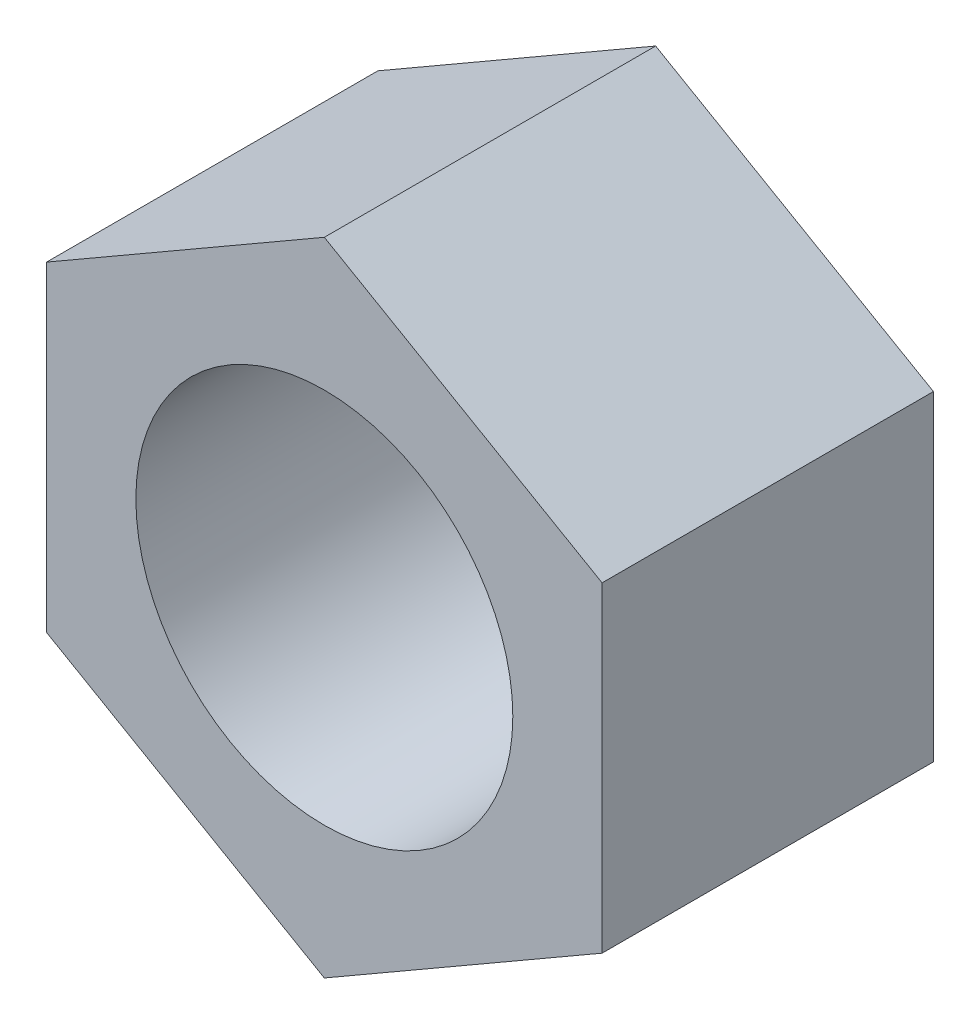
ISO-10303-21;
HEADER;
FILE_DESCRIPTION(('STEP AP214'),'2;1');
FILE_NAME('part.step','',(''),(''),'','','');
FILE_SCHEMA(('AUTOMOTIVE_DESIGN { 1 0 10303 214 1 1 1 1 }'));
ENDSEC;
DATA;
#1=APPLICATION_CONTEXT('core data for automotive mechanical design processes');
#2=APPLICATION_PROTOCOL_DEFINITION('international standard','automotive_design',2000,#1);
#3=PRODUCT_CONTEXT('',#1,'mechanical');
#4=PRODUCT('Part','Part','',(#3));
#5=PRODUCT_RELATED_PRODUCT_CATEGORY('part','',(#4));
#6=PRODUCT_DEFINITION_FORMATION('','',#4);
#7=PRODUCT_DEFINITION_CONTEXT('part definition',#1,'design');
#8=PRODUCT_DEFINITION('design','',#6,#7);
#9=PRODUCT_DEFINITION_SHAPE('','',#8);
#10=(LENGTH_UNIT() NAMED_UNIT(*) SI_UNIT(.MILLI.,.METRE.));
#11=(NAMED_UNIT(*) PLANE_ANGLE_UNIT() SI_UNIT($,.RADIAN.));
#12=(NAMED_UNIT(*) SI_UNIT($,.STERADIAN.) SOLID_ANGLE_UNIT());
#13=UNCERTAINTY_MEASURE_WITH_UNIT(LENGTH_MEASURE(1.E-05),#10,'distance_accuracy_value','');
#14=(GEOMETRIC_REPRESENTATION_CONTEXT(3) GLOBAL_UNCERTAINTY_ASSIGNED_CONTEXT((#13)) GLOBAL_UNIT_ASSIGNED_CONTEXT((#10,
#11,#12)) REPRESENTATION_CONTEXT('',''));
#15=CARTESIAN_POINT('',(0.,0.,0.));
#16=DIRECTION('',(0.,0.,1.));
#17=DIRECTION('',(1.,0.,0.));
#18=AXIS2_PLACEMENT_3D('',#15,#16,#17);
#19=CARTESIAN_POINT('',(0.,0.,8.35));
#20=DIRECTION('',(0.,0.,1.));
#21=DIRECTION('',(1.,0.,0.));
#22=AXIS2_PLACEMENT_3D('',#19,#20,#21);
#23=PLANE('',#22);
#24=DIRECTION('',(0.,1.,0.));
#25=VECTOR('',#24,1.);
#26=CARTESIAN_POINT('',(7.,-4.04145188432739,8.35));
#27=LINE('',#26,#25);
#28=CARTESIAN_POINT('',(7.,-4.04145188432739,8.35));
#29=VERTEX_POINT('',#28);
#30=CARTESIAN_POINT('',(7.,4.04145188432738,8.35));
#31=VERTEX_POINT('',#30);
#32=EDGE_CURVE('E129',#29,#31,#27,.T.);
#33=ORIENTED_EDGE('',*,*,#32,.T.);
#34=DIRECTION('',(-0.866025403784439,0.5,0.));
#35=VECTOR('',#34,1.);
#36=CARTESIAN_POINT('',(7.,4.04145188432738,8.35));
#37=LINE('',#36,#35);
#38=CARTESIAN_POINT('',(0.,8.08290376865476,8.35));
#39=VERTEX_POINT('',#38);
#40=EDGE_CURVE('E87',#31,#39,#37,.T.);
#41=ORIENTED_EDGE('',*,*,#40,.T.);
#42=DIRECTION('',(-0.866025403784439,-0.5,0.));
#43=VECTOR('',#42,1.);
#44=CARTESIAN_POINT('',(0.,8.08290376865476,8.35));
#45=LINE('',#44,#43);
#46=CARTESIAN_POINT('',(-7.,4.04145188432738,8.35));
#47=VERTEX_POINT('',#46);
#48=EDGE_CURVE('E100',#39,#47,#45,.T.);
#49=ORIENTED_EDGE('',*,*,#48,.T.);
#50=DIRECTION('',(0.,-1.,0.));
#51=VECTOR('',#50,1.);
#52=CARTESIAN_POINT('',(-7.,4.04145188432738,8.35));
#53=LINE('',#52,#51);
#54=CARTESIAN_POINT('',(-7.,-4.04145188432738,8.35));
#55=VERTEX_POINT('',#54);
#56=EDGE_CURVE('E94',#47,#55,#53,.T.);
#57=ORIENTED_EDGE('',*,*,#56,.T.);
#58=DIRECTION('',(0.866025403784439,-0.5,0.));
#59=VECTOR('',#58,1.);
#60=CARTESIAN_POINT('',(-7.,-4.04145188432738,8.35));
#61=LINE('',#60,#59);
#62=CARTESIAN_POINT('',(0.,-8.08290376865476,8.35));
#63=VERTEX_POINT('',#62);
#64=EDGE_CURVE('E98',#55,#63,#61,.T.);
#65=ORIENTED_EDGE('',*,*,#64,.T.);
#66=DIRECTION('',(0.866025403784438,0.5,0.));
#67=VECTOR('',#66,1.);
#68=CARTESIAN_POINT('',(0.,-8.08290376865476,8.35));
#69=LINE('',#68,#67);
#70=EDGE_CURVE('E50',#63,#29,#69,.T.);
#71=ORIENTED_EDGE('',*,*,#70,.T.);
#72=EDGE_LOOP('',(#33,#41,#49,#57,#65,#71));
#73=FACE_BOUND('',#72,.T.);
#74=CARTESIAN_POINT('',(0.,0.,8.35));
#75=DIRECTION('',(0.,0.,1.));
#76=DIRECTION('',(1.,0.,0.));
#77=AXIS2_PLACEMENT_3D('',#74,#75,#76);
#78=CIRCLE('',#77,4.75);
#79=CARTESIAN_POINT('',(4.75,0.,8.35));
#80=VERTEX_POINT('',#79);
#81=EDGE_CURVE('E122',#80,#80,#78,.T.);
#82=ORIENTED_EDGE('',*,*,#81,.F.);
#83=EDGE_LOOP('',(#82));
#84=FACE_BOUND('',#83,.T.);
#85=ADVANCED_FACE('F33',(#73,#84),#23,.T.);
#86=CARTESIAN_POINT('',(0.,0.,0.));
#87=DIRECTION('',(0.,0.,1.));
#88=DIRECTION('',(1.,0.,0.));
#89=AXIS2_PLACEMENT_3D('',#86,#87,#88);
#90=PLANE('',#89);
#91=DIRECTION('',(0.,1.,0.));
#92=VECTOR('',#91,1.);
#93=CARTESIAN_POINT('',(7.,-4.04145188432739,0.));
#94=LINE('',#93,#92);
#95=CARTESIAN_POINT('',(7.,-4.04145188432739,0.));
#96=VERTEX_POINT('',#95);
#97=CARTESIAN_POINT('',(7.,4.04145188432738,0.));
#98=VERTEX_POINT('',#97);
#99=EDGE_CURVE('E118',#96,#98,#94,.T.);
#100=ORIENTED_EDGE('',*,*,#99,.F.);
#101=DIRECTION('',(0.866025403784438,0.5,0.));
#102=VECTOR('',#101,1.);
#103=CARTESIAN_POINT('',(0.,-8.08290376865476,0.));
#104=LINE('',#103,#102);
#105=CARTESIAN_POINT('',(0.,-8.08290376865476,0.));
#106=VERTEX_POINT('',#105);
#107=EDGE_CURVE('E79',#106,#96,#104,.T.);
#108=ORIENTED_EDGE('',*,*,#107,.F.);
#109=DIRECTION('',(0.866025403784439,-0.5,0.));
#110=VECTOR('',#109,1.);
#111=CARTESIAN_POINT('',(-7.,-4.04145188432738,0.));
#112=LINE('',#111,#110);
#113=CARTESIAN_POINT('',(-7.,-4.04145188432738,0.));
#114=VERTEX_POINT('',#113);
#115=EDGE_CURVE('E73',#114,#106,#112,.T.);
#116=ORIENTED_EDGE('',*,*,#115,.F.);
#117=DIRECTION('',(0.,-1.,0.));
#118=VECTOR('',#117,1.);
#119=CARTESIAN_POINT('',(-7.,4.04145188432738,0.));
#120=LINE('',#119,#118);
#121=CARTESIAN_POINT('',(-7.,4.04145188432738,0.));
#122=VERTEX_POINT('',#121);
#123=EDGE_CURVE('E108',#122,#114,#120,.T.);
#124=ORIENTED_EDGE('',*,*,#123,.F.);
#125=DIRECTION('',(-0.866025403784439,-0.5,0.));
#126=VECTOR('',#125,1.);
#127=CARTESIAN_POINT('',(0.,8.08290376865476,0.));
#128=LINE('',#127,#126);
#129=CARTESIAN_POINT('',(0.,8.08290376865476,0.));
#130=VERTEX_POINT('',#129);
#131=EDGE_CURVE('E124',#130,#122,#128,.T.);
#132=ORIENTED_EDGE('',*,*,#131,.F.);
#133=DIRECTION('',(-0.866025403784439,0.5,0.));
#134=VECTOR('',#133,1.);
#135=CARTESIAN_POINT('',(7.,4.04145188432738,0.));
#136=LINE('',#135,#134);
#137=EDGE_CURVE('E121',#98,#130,#136,.T.);
#138=ORIENTED_EDGE('',*,*,#137,.F.);
#139=EDGE_LOOP('',(#100,#108,#116,#124,#132,#138));
#140=FACE_BOUND('',#139,.T.);
#141=CARTESIAN_POINT('',(0.,0.,0.));
#142=DIRECTION('',(0.,0.,1.));
#143=DIRECTION('',(1.,0.,0.));
#144=AXIS2_PLACEMENT_3D('',#141,#142,#143);
#145=CIRCLE('',#144,4.75);
#146=CARTESIAN_POINT('',(4.75,0.,0.));
#147=VERTEX_POINT('',#146);
#148=EDGE_CURVE('E222',#147,#147,#145,.T.);
#149=ORIENTED_EDGE('',*,*,#148,.T.);
#150=EDGE_LOOP('',(#149));
#151=FACE_BOUND('',#150,.T.);
#152=ADVANCED_FACE('F138',(#140,#151),#90,.F.);
#153=CARTESIAN_POINT('',(7.,-4.04145188432739,8.35));
#154=DIRECTION('',(-1.,0.,0.));
#155=DIRECTION('',(0.,-1.,0.));
#156=AXIS2_PLACEMENT_3D('',#153,#154,#155);
#157=PLANE('',#156);
#158=ORIENTED_EDGE('',*,*,#99,.T.);
#159=DIRECTION('',(0.,0.,-1.));
#160=VECTOR('',#159,1.);
#161=CARTESIAN_POINT('',(7.,4.04145188432738,8.35));
#162=LINE('',#161,#160);
#163=EDGE_CURVE('E11',#31,#98,#162,.T.);
#164=ORIENTED_EDGE('',*,*,#163,.F.);
#165=ORIENTED_EDGE('',*,*,#32,.F.);
#166=DIRECTION('',(0.,0.,-1.));
#167=VECTOR('',#166,1.);
#168=CARTESIAN_POINT('',(7.,-4.04145188432739,8.35));
#169=LINE('',#168,#167);
#170=EDGE_CURVE('E114',#29,#96,#169,.T.);
#171=ORIENTED_EDGE('',*,*,#170,.T.);
#172=EDGE_LOOP('',(#158,#164,#165,#171));
#173=FACE_BOUND('',#172,.T.);
#174=ADVANCED_FACE('F35',(#173),#157,.F.);
#175=CARTESIAN_POINT('',(7.,4.04145188432738,8.35));
#176=DIRECTION('',(-0.5,-0.866025403784439,0.));
#177=DIRECTION('',(0.866025403784439,-0.5,0.));
#178=AXIS2_PLACEMENT_3D('',#175,#176,#177);
#179=PLANE('',#178);
#180=ORIENTED_EDGE('',*,*,#137,.T.);
#181=DIRECTION('',(0.,0.,-1.));
#182=VECTOR('',#181,1.);
#183=CARTESIAN_POINT('',(0.,8.08290376865476,8.35));
#184=LINE('',#183,#182);
#185=EDGE_CURVE('E42',#39,#130,#184,.T.);
#186=ORIENTED_EDGE('',*,*,#185,.F.);
#187=ORIENTED_EDGE('',*,*,#40,.F.);
#188=ORIENTED_EDGE('',*,*,#163,.T.);
#189=EDGE_LOOP('',(#180,#186,#187,#188));
#190=FACE_BOUND('',#189,.T.);
#191=ADVANCED_FACE('F163',(#190),#179,.F.);
#192=CARTESIAN_POINT('',(0.,8.08290376865476,8.35));
#193=DIRECTION('',(0.5,-0.866025403784439,0.));
#194=DIRECTION('',(0.866025403784439,0.5,0.));
#195=AXIS2_PLACEMENT_3D('',#192,#193,#194);
#196=PLANE('',#195);
#197=ORIENTED_EDGE('',*,*,#131,.T.);
#198=DIRECTION('',(0.,0.,-1.));
#199=VECTOR('',#198,1.);
#200=CARTESIAN_POINT('',(-7.,4.04145188432738,8.35));
#201=LINE('',#200,#199);
#202=EDGE_CURVE('E109',#47,#122,#201,.T.);
#203=ORIENTED_EDGE('',*,*,#202,.F.);
#204=ORIENTED_EDGE('',*,*,#48,.F.);
#205=ORIENTED_EDGE('',*,*,#185,.T.);
#206=EDGE_LOOP('',(#197,#203,#204,#205));
#207=FACE_BOUND('',#206,.T.);
#208=ADVANCED_FACE('F135',(#207),#196,.F.);
#209=CARTESIAN_POINT('',(-7.,4.04145188432738,8.35));
#210=DIRECTION('',(1.,0.,0.));
#211=DIRECTION('',(0.,1.,0.));
#212=AXIS2_PLACEMENT_3D('',#209,#210,#211);
#213=PLANE('',#212);
#214=ORIENTED_EDGE('',*,*,#123,.T.);
#215=DIRECTION('',(0.,0.,-1.));
#216=VECTOR('',#215,1.);
#217=CARTESIAN_POINT('',(-7.,-4.04145188432738,8.35));
#218=LINE('',#217,#216);
#219=EDGE_CURVE('E105',#55,#114,#218,.T.);
#220=ORIENTED_EDGE('',*,*,#219,.F.);
#221=ORIENTED_EDGE('',*,*,#56,.F.);
#222=ORIENTED_EDGE('',*,*,#202,.T.);
#223=EDGE_LOOP('',(#214,#220,#221,#222));
#224=FACE_BOUND('',#223,.T.);
#225=ADVANCED_FACE('F106',(#224),#213,.F.);
#226=CARTESIAN_POINT('',(-7.,-4.04145188432738,8.35));
#227=DIRECTION('',(0.5,0.866025403784439,0.));
#228=DIRECTION('',(-0.866025403784439,0.5,0.));
#229=AXIS2_PLACEMENT_3D('',#226,#227,#228);
#230=PLANE('',#229);
#231=ORIENTED_EDGE('',*,*,#115,.T.);
#232=DIRECTION('',(0.,0.,-1.));
#233=VECTOR('',#232,1.);
#234=CARTESIAN_POINT('',(0.,-8.08290376865476,8.35));
#235=LINE('',#234,#233);
#236=EDGE_CURVE('E110',#63,#106,#235,.T.);
#237=ORIENTED_EDGE('',*,*,#236,.F.);
#238=ORIENTED_EDGE('',*,*,#64,.F.);
#239=ORIENTED_EDGE('',*,*,#219,.T.);
#240=EDGE_LOOP('',(#231,#237,#238,#239));
#241=FACE_BOUND('',#240,.T.);
#242=ADVANCED_FACE('F112',(#241),#230,.F.);
#243=CARTESIAN_POINT('',(0.,-8.08290376865476,8.35));
#244=DIRECTION('',(-0.5,0.866025403784439,0.));
#245=DIRECTION('',(-0.866025403784439,-0.5,0.));
#246=AXIS2_PLACEMENT_3D('',#243,#244,#245);
#247=PLANE('',#246);
#248=ORIENTED_EDGE('',*,*,#107,.T.);
#249=ORIENTED_EDGE('',*,*,#170,.F.);
#250=ORIENTED_EDGE('',*,*,#70,.F.);
#251=ORIENTED_EDGE('',*,*,#236,.T.);
#252=EDGE_LOOP('',(#248,#249,#250,#251));
#253=FACE_BOUND('',#252,.T.);
#254=ADVANCED_FACE('F143',(#253),#247,.F.);
#255=CARTESIAN_POINT('',(0.,0.,8.35));
#256=DIRECTION('',(0.,0.,-1.));
#257=DIRECTION('',(-1.,0.,0.));
#258=AXIS2_PLACEMENT_3D('',#255,#256,#257);
#259=CYLINDRICAL_SURFACE('',#258,4.75);
#260=ORIENTED_EDGE('',*,*,#81,.T.);
#261=EDGE_LOOP('',(#260));
#262=FACE_BOUND('',#261,.T.);
#263=ORIENTED_EDGE('',*,*,#148,.F.);
#264=EDGE_LOOP('',(#263));
#265=FACE_BOUND('',#264,.T.);
#266=ADVANCED_FACE('F145',(#262,#265),#259,.F.);
#267=CLOSED_SHELL('',(#85,#152,#174,#191,#208,#225,#242,#254,#266));
#268=MANIFOLD_SOLID_BREP('B2',#267);
#269=ADVANCED_BREP_SHAPE_REPRESENTATION('',(#18,#268),#14);
#270=SHAPE_DEFINITION_REPRESENTATION(#9,#269);
ENDSEC;
END-ISO-10303-21;
